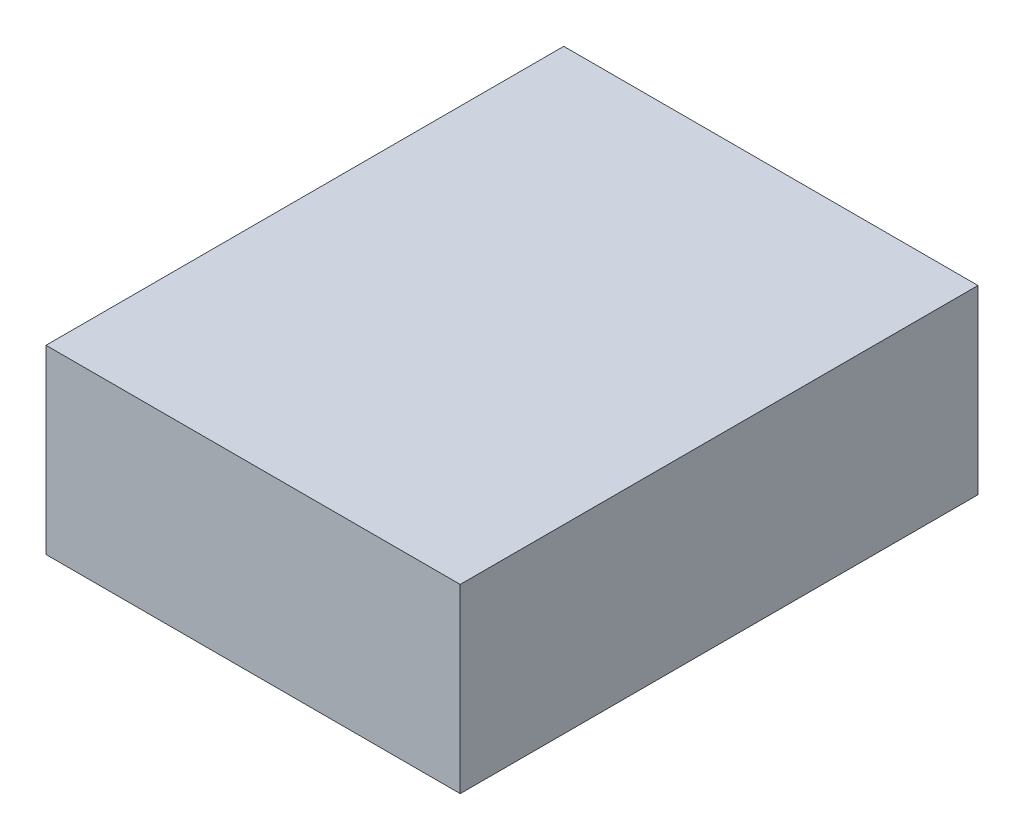
ISO-10303-21;
HEADER;
FILE_DESCRIPTION(('STEP AP214'),'2;1');
FILE_NAME('part.step','',(''),(''),'','','');
FILE_SCHEMA(('AUTOMOTIVE_DESIGN { 1 0 10303 214 1 1 1 1 }'));
ENDSEC;
DATA;
#1=APPLICATION_CONTEXT('core data for automotive mechanical design processes');
#2=APPLICATION_PROTOCOL_DEFINITION('international standard','automotive_design',2000,#1);
#3=PRODUCT_CONTEXT('',#1,'mechanical');
#4=PRODUCT('Part','Part','',(#3));
#5=PRODUCT_RELATED_PRODUCT_CATEGORY('part','',(#4));
#6=PRODUCT_DEFINITION_FORMATION('','',#4);
#7=PRODUCT_DEFINITION_CONTEXT('part definition',#1,'design');
#8=PRODUCT_DEFINITION('design','',#6,#7);
#9=PRODUCT_DEFINITION_SHAPE('','',#8);
#10=(LENGTH_UNIT() NAMED_UNIT(*) SI_UNIT(.MILLI.,.METRE.));
#11=(NAMED_UNIT(*) PLANE_ANGLE_UNIT() SI_UNIT($,.RADIAN.));
#12=(NAMED_UNIT(*) SI_UNIT($,.STERADIAN.) SOLID_ANGLE_UNIT());
#13=UNCERTAINTY_MEASURE_WITH_UNIT(LENGTH_MEASURE(1.E-05),#10,'distance_accuracy_value','');
#14=(GEOMETRIC_REPRESENTATION_CONTEXT(3) GLOBAL_UNCERTAINTY_ASSIGNED_CONTEXT((#13)) GLOBAL_UNIT_ASSIGNED_CONTEXT((#10,
#11,#12)) REPRESENTATION_CONTEXT('',''));
#15=CARTESIAN_POINT('',(0.,0.,0.));
#16=DIRECTION('',(0.,0.,1.));
#17=DIRECTION('',(1.,0.,0.));
#18=AXIS2_PLACEMENT_3D('',#15,#16,#17);
#19=CARTESIAN_POINT('',(-40.,35.,-50.));
#20=DIRECTION('',(1.,0.,0.));
#21=DIRECTION('',(0.,0.,-1.));
#22=AXIS2_PLACEMENT_3D('',#19,#20,#21);
#23=PLANE('',#22);
#24=DIRECTION('',(0.,0.,1.));
#25=VECTOR('',#24,1.);
#26=CARTESIAN_POINT('',(-40.,0.,-50.));
#27=LINE('',#26,#25);
#28=CARTESIAN_POINT('',(-40.,0.,-50.));
#29=VERTEX_POINT('',#28);
#30=CARTESIAN_POINT('',(-40.,0.,50.));
#31=VERTEX_POINT('',#30);
#32=EDGE_CURVE('E98',#29,#31,#27,.T.);
#33=ORIENTED_EDGE('',*,*,#32,.T.);
#34=DIRECTION('',(0.,-1.,0.));
#35=VECTOR('',#34,1.);
#36=CARTESIAN_POINT('',(-40.,35.,50.));
#37=LINE('',#36,#35);
#38=CARTESIAN_POINT('',(-40.,35.,50.));
#39=VERTEX_POINT('',#38);
#40=EDGE_CURVE('E11',#39,#31,#37,.T.);
#41=ORIENTED_EDGE('',*,*,#40,.F.);
#42=DIRECTION('',(0.,0.,1.));
#43=VECTOR('',#42,1.);
#44=CARTESIAN_POINT('',(-40.,35.,-50.));
#45=LINE('',#44,#43);
#46=CARTESIAN_POINT('',(-40.,35.,-50.));
#47=VERTEX_POINT('',#46);
#48=EDGE_CURVE('E86',#47,#39,#45,.T.);
#49=ORIENTED_EDGE('',*,*,#48,.F.);
#50=DIRECTION('',(0.,-1.,0.));
#51=VECTOR('',#50,1.);
#52=CARTESIAN_POINT('',(-40.,35.,-50.));
#53=LINE('',#52,#51);
#54=EDGE_CURVE('E94',#47,#29,#53,.T.);
#55=ORIENTED_EDGE('',*,*,#54,.T.);
#56=EDGE_LOOP('',(#33,#41,#49,#55));
#57=FACE_BOUND('',#56,.T.);
#58=ADVANCED_FACE('F35',(#57),#23,.F.);
#59=CARTESIAN_POINT('',(-40.,35.,50.));
#60=DIRECTION('',(0.,0.,-1.));
#61=DIRECTION('',(-1.,0.,0.));
#62=AXIS2_PLACEMENT_3D('',#59,#60,#61);
#63=PLANE('',#62);
#64=DIRECTION('',(1.,0.,0.));
#65=VECTOR('',#64,1.);
#66=CARTESIAN_POINT('',(-40.,0.,50.));
#67=LINE('',#66,#65);
#68=CARTESIAN_POINT('',(40.,0.,50.));
#69=VERTEX_POINT('',#68);
#70=EDGE_CURVE('E90',#31,#69,#67,.T.);
#71=ORIENTED_EDGE('',*,*,#70,.T.);
#72=DIRECTION('',(0.,-1.,0.));
#73=VECTOR('',#72,1.);
#74=CARTESIAN_POINT('',(40.,35.,50.));
#75=LINE('',#74,#73);
#76=CARTESIAN_POINT('',(40.,35.,50.));
#77=VERTEX_POINT('',#76);
#78=EDGE_CURVE('E43',#77,#69,#75,.T.);
#79=ORIENTED_EDGE('',*,*,#78,.F.);
#80=DIRECTION('',(1.,0.,0.));
#81=VECTOR('',#80,1.);
#82=CARTESIAN_POINT('',(-40.,35.,50.));
#83=LINE('',#82,#81);
#84=EDGE_CURVE('E81',#39,#77,#83,.T.);
#85=ORIENTED_EDGE('',*,*,#84,.F.);
#86=ORIENTED_EDGE('',*,*,#40,.T.);
#87=EDGE_LOOP('',(#71,#79,#85,#86));
#88=FACE_BOUND('',#87,.T.);
#89=ADVANCED_FACE('F89',(#88),#63,.F.);
#90=CARTESIAN_POINT('',(40.,35.,-50.));
#91=DIRECTION('',(-1.,0.,0.));
#92=DIRECTION('',(0.,0.,1.));
#93=AXIS2_PLACEMENT_3D('',#90,#91,#92);
#94=PLANE('',#93);
#95=DIRECTION('',(0.,0.,-1.));
#96=VECTOR('',#95,1.);
#97=CARTESIAN_POINT('',(40.,0.,-50.));
#98=LINE('',#97,#96);
#99=CARTESIAN_POINT('',(40.,0.,-50.));
#100=VERTEX_POINT('',#99);
#101=EDGE_CURVE('E68',#69,#100,#98,.T.);
#102=ORIENTED_EDGE('',*,*,#101,.T.);
#103=DIRECTION('',(0.,-1.,0.));
#104=VECTOR('',#103,1.);
#105=CARTESIAN_POINT('',(40.,35.,-50.));
#106=LINE('',#105,#104);
#107=CARTESIAN_POINT('',(40.,35.,-50.));
#108=VERTEX_POINT('',#107);
#109=EDGE_CURVE('E91',#108,#100,#106,.T.);
#110=ORIENTED_EDGE('',*,*,#109,.F.);
#111=DIRECTION('',(0.,0.,-1.));
#112=VECTOR('',#111,1.);
#113=CARTESIAN_POINT('',(40.,35.,-50.));
#114=LINE('',#113,#112);
#115=EDGE_CURVE('E84',#77,#108,#114,.T.);
#116=ORIENTED_EDGE('',*,*,#115,.F.);
#117=ORIENTED_EDGE('',*,*,#78,.T.);
#118=EDGE_LOOP('',(#102,#110,#116,#117));
#119=FACE_BOUND('',#118,.T.);
#120=ADVANCED_FACE('F92',(#119),#94,.F.);
#121=CARTESIAN_POINT('',(-40.,35.,-50.));
#122=DIRECTION('',(0.,0.,1.));
#123=DIRECTION('',(1.,0.,0.));
#124=AXIS2_PLACEMENT_3D('',#121,#122,#123);
#125=PLANE('',#124);
#126=DIRECTION('',(-1.,0.,0.));
#127=VECTOR('',#126,1.);
#128=CARTESIAN_POINT('',(-40.,0.,-50.));
#129=LINE('',#128,#127);
#130=EDGE_CURVE('E74',#100,#29,#129,.T.);
#131=ORIENTED_EDGE('',*,*,#130,.T.);
#132=ORIENTED_EDGE('',*,*,#54,.F.);
#133=DIRECTION('',(-1.,0.,0.));
#134=VECTOR('',#133,1.);
#135=CARTESIAN_POINT('',(-40.,35.,-50.));
#136=LINE('',#135,#134);
#137=EDGE_CURVE('E51',#108,#47,#136,.T.);
#138=ORIENTED_EDGE('',*,*,#137,.F.);
#139=ORIENTED_EDGE('',*,*,#109,.T.);
#140=EDGE_LOOP('',(#131,#132,#138,#139));
#141=FACE_BOUND('',#140,.T.);
#142=ADVANCED_FACE('F105',(#141),#125,.F.);
#143=CARTESIAN_POINT('',(0.,35.,0.));
#144=DIRECTION('',(0.,1.,0.));
#145=DIRECTION('',(0.,0.,1.));
#146=AXIS2_PLACEMENT_3D('',#143,#144,#145);
#147=PLANE('',#146);
#148=ORIENTED_EDGE('',*,*,#48,.T.);
#149=ORIENTED_EDGE('',*,*,#84,.T.);
#150=ORIENTED_EDGE('',*,*,#115,.T.);
#151=ORIENTED_EDGE('',*,*,#137,.T.);
#152=EDGE_LOOP('',(#148,#149,#150,#151));
#153=FACE_BOUND('',#152,.T.);
#154=ADVANCED_FACE('F82',(#153),#147,.T.);
#155=CARTESIAN_POINT('',(0.,0.,0.));
#156=DIRECTION('',(0.,1.,0.));
#157=DIRECTION('',(0.,0.,1.));
#158=AXIS2_PLACEMENT_3D('',#155,#156,#157);
#159=PLANE('',#158);
#160=ORIENTED_EDGE('',*,*,#32,.F.);
#161=ORIENTED_EDGE('',*,*,#130,.F.);
#162=ORIENTED_EDGE('',*,*,#101,.F.);
#163=ORIENTED_EDGE('',*,*,#70,.F.);
#164=EDGE_LOOP('',(#160,#161,#162,#163));
#165=FACE_BOUND('',#164,.T.);
#166=ADVANCED_FACE('F108',(#165),#159,.F.);
#167=CLOSED_SHELL('',(#58,#89,#120,#142,#154,#166));
#168=MANIFOLD_SOLID_BREP('B2',#167);
#169=ADVANCED_BREP_SHAPE_REPRESENTATION('',(#18,#168),#14);
#170=SHAPE_DEFINITION_REPRESENTATION(#9,#169);
ENDSEC;
END-ISO-10303-21;
